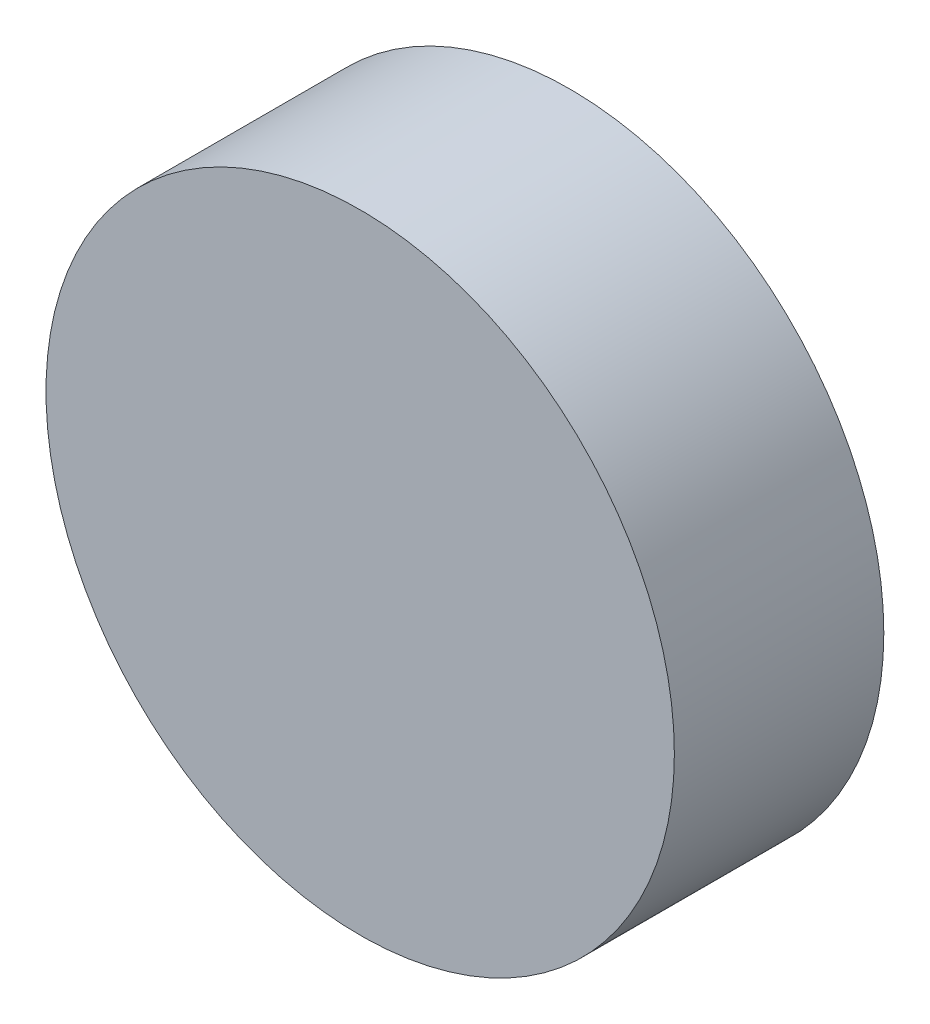
ISO-10303-21;
HEADER;
FILE_DESCRIPTION(('STEP AP214'),'2;1');
FILE_NAME('part.step','',(''),(''),'','','');
FILE_SCHEMA(('AUTOMOTIVE_DESIGN { 1 0 10303 214 1 1 1 1 }'));
ENDSEC;
DATA;
#1=APPLICATION_CONTEXT('core data for automotive mechanical design processes');
#2=APPLICATION_PROTOCOL_DEFINITION('international standard','automotive_design',2000,#1);
#3=PRODUCT_CONTEXT('',#1,'mechanical');
#4=PRODUCT('Part','Part','',(#3));
#5=PRODUCT_RELATED_PRODUCT_CATEGORY('part','',(#4));
#6=PRODUCT_DEFINITION_FORMATION('','',#4);
#7=PRODUCT_DEFINITION_CONTEXT('part definition',#1,'design');
#8=PRODUCT_DEFINITION('design','',#6,#7);
#9=PRODUCT_DEFINITION_SHAPE('','',#8);
#10=(LENGTH_UNIT() NAMED_UNIT(*) SI_UNIT(.MILLI.,.METRE.));
#11=(NAMED_UNIT(*) PLANE_ANGLE_UNIT() SI_UNIT($,.RADIAN.));
#12=(NAMED_UNIT(*) SI_UNIT($,.STERADIAN.) SOLID_ANGLE_UNIT());
#13=UNCERTAINTY_MEASURE_WITH_UNIT(LENGTH_MEASURE(1.E-05),#10,'distance_accuracy_value','');
#14=(GEOMETRIC_REPRESENTATION_CONTEXT(3) GLOBAL_UNCERTAINTY_ASSIGNED_CONTEXT((#13)) GLOBAL_UNIT_ASSIGNED_CONTEXT((#10,
#11,#12)) REPRESENTATION_CONTEXT('',''));
#15=CARTESIAN_POINT('',(0.,0.,0.));
#16=DIRECTION('',(0.,0.,1.));
#17=DIRECTION('',(1.,0.,0.));
#18=AXIS2_PLACEMENT_3D('',#15,#16,#17);
#19=CARTESIAN_POINT('',(0.,0.,10.));
#20=DIRECTION('',(0.,0.,-1.));
#21=DIRECTION('',(-1.,0.,0.));
#22=AXIS2_PLACEMENT_3D('',#19,#20,#21);
#23=CYLINDRICAL_SURFACE('',#22,15.);
#24=CARTESIAN_POINT('',(0.,0.,10.));
#25=DIRECTION('',(0.,0.,1.));
#26=DIRECTION('',(1.,0.,0.));
#27=AXIS2_PLACEMENT_3D('',#24,#25,#26);
#28=CIRCLE('',#27,15.);
#29=CARTESIAN_POINT('',(15.,0.,10.));
#30=VERTEX_POINT('',#29);
#31=EDGE_CURVE('E10',#30,#30,#28,.T.);
#32=ORIENTED_EDGE('',*,*,#31,.F.);
#33=EDGE_LOOP('',(#32));
#34=FACE_BOUND('',#33,.T.);
#35=CARTESIAN_POINT('',(0.,0.,0.));
#36=DIRECTION('',(0.,0.,1.));
#37=DIRECTION('',(1.,0.,0.));
#38=AXIS2_PLACEMENT_3D('',#35,#36,#37);
#39=CIRCLE('',#38,15.);
#40=CARTESIAN_POINT('',(15.,0.,0.));
#41=VERTEX_POINT('',#40);
#42=EDGE_CURVE('E42',#41,#41,#39,.T.);
#43=ORIENTED_EDGE('',*,*,#42,.T.);
#44=EDGE_LOOP('',(#43));
#45=FACE_BOUND('',#44,.T.);
#46=ADVANCED_FACE('F39',(#34,#45),#23,.T.);
#47=CARTESIAN_POINT('',(0.,0.,10.));
#48=DIRECTION('',(0.,0.,1.));
#49=DIRECTION('',(1.,0.,0.));
#50=AXIS2_PLACEMENT_3D('',#47,#48,#49);
#51=PLANE('',#50);
#52=ORIENTED_EDGE('',*,*,#31,.T.);
#53=EDGE_LOOP('',(#52));
#54=FACE_BOUND('',#53,.T.);
#55=ADVANCED_FACE('F56',(#54),#51,.T.);
#56=CARTESIAN_POINT('',(0.,0.,0.));
#57=DIRECTION('',(0.,0.,1.));
#58=DIRECTION('',(1.,0.,0.));
#59=AXIS2_PLACEMENT_3D('',#56,#57,#58);
#60=PLANE('',#59);
#61=ORIENTED_EDGE('',*,*,#42,.F.);
#62=EDGE_LOOP('',(#61));
#63=FACE_BOUND('',#62,.T.);
#64=ADVANCED_FACE('F54',(#63),#60,.F.);
#65=CLOSED_SHELL('',(#46,#55,#64));
#66=MANIFOLD_SOLID_BREP('B2',#65);
#67=ADVANCED_BREP_SHAPE_REPRESENTATION('',(#18,#66),#14);
#68=SHAPE_DEFINITION_REPRESENTATION(#9,#67);
ENDSEC;
END-ISO-10303-21;
